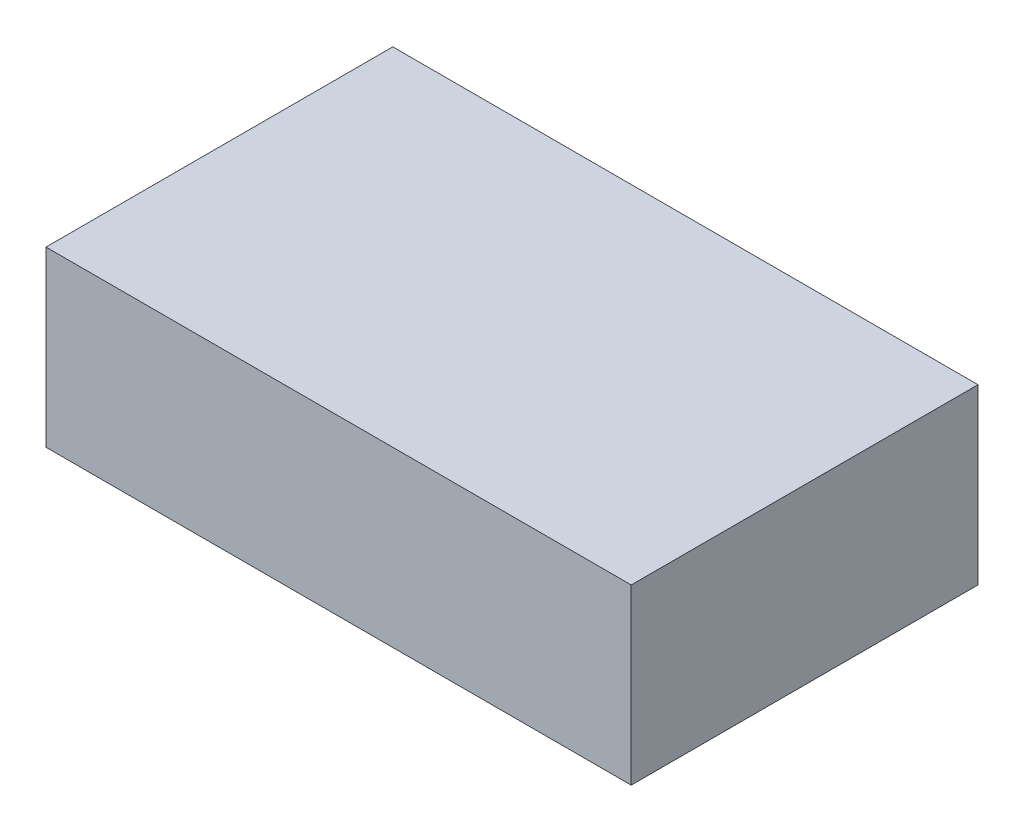
ISO-10303-21;
HEADER;
FILE_DESCRIPTION(('STEP AP214'),'2;1');
FILE_NAME('part.step','',(''),(''),'','','');
FILE_SCHEMA(('AUTOMOTIVE_DESIGN { 1 0 10303 214 1 1 1 1 }'));
ENDSEC;
DATA;
#1=APPLICATION_CONTEXT('core data for automotive mechanical design processes');
#2=APPLICATION_PROTOCOL_DEFINITION('international standard','automotive_design',2000,#1);
#3=PRODUCT_CONTEXT('',#1,'mechanical');
#4=PRODUCT('Part','Part','',(#3));
#5=PRODUCT_RELATED_PRODUCT_CATEGORY('part','',(#4));
#6=PRODUCT_DEFINITION_FORMATION('','',#4);
#7=PRODUCT_DEFINITION_CONTEXT('part definition',#1,'design');
#8=PRODUCT_DEFINITION('design','',#6,#7);
#9=PRODUCT_DEFINITION_SHAPE('','',#8);
#10=(LENGTH_UNIT() NAMED_UNIT(*) SI_UNIT(.MILLI.,.METRE.));
#11=(NAMED_UNIT(*) PLANE_ANGLE_UNIT() SI_UNIT($,.RADIAN.));
#12=(NAMED_UNIT(*) SI_UNIT($,.STERADIAN.) SOLID_ANGLE_UNIT());
#13=UNCERTAINTY_MEASURE_WITH_UNIT(LENGTH_MEASURE(1.E-05),#10,'distance_accuracy_value','');
#14=(GEOMETRIC_REPRESENTATION_CONTEXT(3) GLOBAL_UNCERTAINTY_ASSIGNED_CONTEXT((#13)) GLOBAL_UNIT_ASSIGNED_CONTEXT((#10,
#11,#12)) REPRESENTATION_CONTEXT('',''));
#15=CARTESIAN_POINT('',(0.,0.,0.));
#16=DIRECTION('',(0.,0.,1.));
#17=DIRECTION('',(1.,0.,0.));
#18=AXIS2_PLACEMENT_3D('',#15,#16,#17);
#19=CARTESIAN_POINT('',(85.725,25.4,50.8));
#20=DIRECTION('',(-1.,0.,0.));
#21=DIRECTION('',(0.,0.,1.));
#22=AXIS2_PLACEMENT_3D('',#19,#20,#21);
#23=PLANE('',#22);
#24=DIRECTION('',(0.,0.,-1.));
#25=VECTOR('',#24,1.);
#26=CARTESIAN_POINT('',(85.725,-25.4,50.8));
#27=LINE('',#26,#25);
#28=CARTESIAN_POINT('',(85.725,-25.4,50.8));
#29=VERTEX_POINT('',#28);
#30=CARTESIAN_POINT('',(85.725,-25.4,-50.8));
#31=VERTEX_POINT('',#30);
#32=EDGE_CURVE('E111',#29,#31,#27,.T.);
#33=ORIENTED_EDGE('',*,*,#32,.T.);
#34=DIRECTION('',(0.,-1.,0.));
#35=VECTOR('',#34,1.);
#36=CARTESIAN_POINT('',(85.725,25.4,-50.8));
#37=LINE('',#36,#35);
#38=CARTESIAN_POINT('',(85.725,25.4,-50.8));
#39=VERTEX_POINT('',#38);
#40=EDGE_CURVE('E11',#39,#31,#37,.T.);
#41=ORIENTED_EDGE('',*,*,#40,.F.);
#42=DIRECTION('',(0.,0.,-1.));
#43=VECTOR('',#42,1.);
#44=CARTESIAN_POINT('',(85.725,25.4,50.8));
#45=LINE('',#44,#43);
#46=CARTESIAN_POINT('',(85.725,25.4,50.8));
#47=VERTEX_POINT('',#46);
#48=EDGE_CURVE('E95',#47,#39,#45,.T.);
#49=ORIENTED_EDGE('',*,*,#48,.F.);
#50=DIRECTION('',(0.,-1.,0.));
#51=VECTOR('',#50,1.);
#52=CARTESIAN_POINT('',(85.725,25.4,50.8));
#53=LINE('',#52,#51);
#54=EDGE_CURVE('E107',#47,#29,#53,.T.);
#55=ORIENTED_EDGE('',*,*,#54,.T.);
#56=EDGE_LOOP('',(#33,#41,#49,#55));
#57=FACE_BOUND('',#56,.T.);
#58=ADVANCED_FACE('F43',(#57),#23,.F.);
#59=CARTESIAN_POINT('',(-85.725,25.4,-50.8));
#60=DIRECTION('',(0.,0.,1.));
#61=DIRECTION('',(1.,0.,0.));
#62=AXIS2_PLACEMENT_3D('',#59,#60,#61);
#63=PLANE('',#62);
#64=DIRECTION('',(-1.,0.,0.));
#65=VECTOR('',#64,1.);
#66=CARTESIAN_POINT('',(-85.725,-25.4,-50.8));
#67=LINE('',#66,#65);
#68=CARTESIAN_POINT('',(-85.725,-25.4,-50.8));
#69=VERTEX_POINT('',#68);
#70=EDGE_CURVE('E100',#31,#69,#67,.T.);
#71=ORIENTED_EDGE('',*,*,#70,.T.);
#72=DIRECTION('',(0.,-1.,0.));
#73=VECTOR('',#72,1.);
#74=CARTESIAN_POINT('',(-85.725,25.4,-50.8));
#75=LINE('',#74,#73);
#76=CARTESIAN_POINT('',(-85.725,25.4,-50.8));
#77=VERTEX_POINT('',#76);
#78=EDGE_CURVE('E52',#77,#69,#75,.T.);
#79=ORIENTED_EDGE('',*,*,#78,.F.);
#80=DIRECTION('',(-1.,0.,0.));
#81=VECTOR('',#80,1.);
#82=CARTESIAN_POINT('',(-85.725,25.4,-50.8));
#83=LINE('',#82,#81);
#84=EDGE_CURVE('E90',#39,#77,#83,.T.);
#85=ORIENTED_EDGE('',*,*,#84,.F.);
#86=ORIENTED_EDGE('',*,*,#40,.T.);
#87=EDGE_LOOP('',(#71,#79,#85,#86));
#88=FACE_BOUND('',#87,.T.);
#89=ADVANCED_FACE('F99',(#88),#63,.F.);
#90=CARTESIAN_POINT('',(-85.725,25.4,50.8));
#91=DIRECTION('',(1.,0.,0.));
#92=DIRECTION('',(0.,0.,-1.));
#93=AXIS2_PLACEMENT_3D('',#90,#91,#92);
#94=PLANE('',#93);
#95=DIRECTION('',(0.,0.,1.));
#96=VECTOR('',#95,1.);
#97=CARTESIAN_POINT('',(-85.725,-25.4,50.8));
#98=LINE('',#97,#96);
#99=CARTESIAN_POINT('',(-85.725,-25.4,50.8));
#100=VERTEX_POINT('',#99);
#101=EDGE_CURVE('E77',#69,#100,#98,.T.);
#102=ORIENTED_EDGE('',*,*,#101,.T.);
#103=DIRECTION('',(0.,-1.,0.));
#104=VECTOR('',#103,1.);
#105=CARTESIAN_POINT('',(-85.725,25.4,50.8));
#106=LINE('',#105,#104);
#107=CARTESIAN_POINT('',(-85.725,25.4,50.8));
#108=VERTEX_POINT('',#107);
#109=EDGE_CURVE('E102',#108,#100,#106,.T.);
#110=ORIENTED_EDGE('',*,*,#109,.F.);
#111=DIRECTION('',(0.,0.,1.));
#112=VECTOR('',#111,1.);
#113=CARTESIAN_POINT('',(-85.725,25.4,50.8));
#114=LINE('',#113,#112);
#115=EDGE_CURVE('E93',#77,#108,#114,.T.);
#116=ORIENTED_EDGE('',*,*,#115,.F.);
#117=ORIENTED_EDGE('',*,*,#78,.T.);
#118=EDGE_LOOP('',(#102,#110,#116,#117));
#119=FACE_BOUND('',#118,.T.);
#120=ADVANCED_FACE('F103',(#119),#94,.F.);
#121=CARTESIAN_POINT('',(-85.725,25.4,50.8));
#122=DIRECTION('',(0.,0.,-1.));
#123=DIRECTION('',(-1.,0.,0.));
#124=AXIS2_PLACEMENT_3D('',#121,#122,#123);
#125=PLANE('',#124);
#126=DIRECTION('',(1.,0.,0.));
#127=VECTOR('',#126,1.);
#128=CARTESIAN_POINT('',(-85.725,-25.4,50.8));
#129=LINE('',#128,#127);
#130=EDGE_CURVE('E83',#100,#29,#129,.T.);
#131=ORIENTED_EDGE('',*,*,#130,.T.);
#132=ORIENTED_EDGE('',*,*,#54,.F.);
#133=DIRECTION('',(1.,0.,0.));
#134=VECTOR('',#133,1.);
#135=CARTESIAN_POINT('',(-85.725,25.4,50.8));
#136=LINE('',#135,#134);
#137=EDGE_CURVE('E60',#108,#47,#136,.T.);
#138=ORIENTED_EDGE('',*,*,#137,.F.);
#139=ORIENTED_EDGE('',*,*,#109,.T.);
#140=EDGE_LOOP('',(#131,#132,#138,#139));
#141=FACE_BOUND('',#140,.T.);
#142=ADVANCED_FACE('F124',(#141),#125,.F.);
#143=CARTESIAN_POINT('',(0.,25.4,0.));
#144=DIRECTION('',(0.,-1.,0.));
#145=DIRECTION('',(0.,0.,-1.));
#146=AXIS2_PLACEMENT_3D('',#143,#144,#145);
#147=PLANE('',#146);
#148=ORIENTED_EDGE('',*,*,#48,.T.);
#149=ORIENTED_EDGE('',*,*,#84,.T.);
#150=ORIENTED_EDGE('',*,*,#115,.T.);
#151=ORIENTED_EDGE('',*,*,#137,.T.);
#152=EDGE_LOOP('',(#148,#149,#150,#151));
#153=FACE_BOUND('',#152,.T.);
#154=ADVANCED_FACE('F91',(#153),#147,.F.);
#155=CARTESIAN_POINT('',(0.,-25.4,0.));
#156=DIRECTION('',(0.,-1.,0.));
#157=DIRECTION('',(0.,0.,-1.));
#158=AXIS2_PLACEMENT_3D('',#155,#156,#157);
#159=PLANE('',#158);
#160=ORIENTED_EDGE('',*,*,#32,.F.);
#161=ORIENTED_EDGE('',*,*,#130,.F.);
#162=ORIENTED_EDGE('',*,*,#101,.F.);
#163=ORIENTED_EDGE('',*,*,#70,.F.);
#164=EDGE_LOOP('',(#160,#161,#162,#163));
#165=FACE_BOUND('',#164,.T.);
#166=ADVANCED_FACE('F127',(#165),#159,.T.);
#167=CLOSED_SHELL('',(#58,#89,#120,#142,#154,#166));
#168=MANIFOLD_SOLID_BREP('B2',#167);
#169=ADVANCED_BREP_SHAPE_REPRESENTATION('',(#18,#168),#14);
#170=SHAPE_DEFINITION_REPRESENTATION(#9,#169);
ENDSEC;
END-ISO-10303-21;
